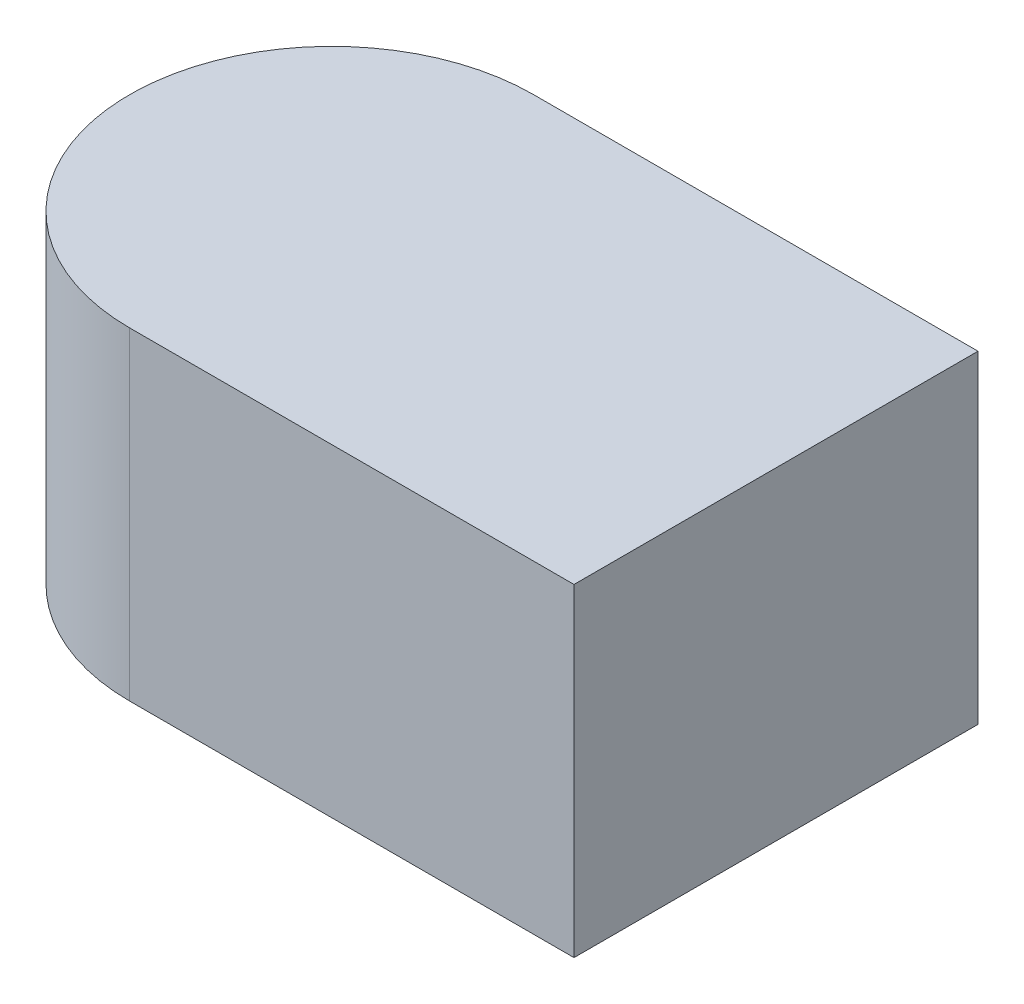
ISO-10303-21;
HEADER;
FILE_DESCRIPTION(('STEP AP214'),'2;1');
FILE_NAME('part.step','',(''),(''),'','','');
FILE_SCHEMA(('AUTOMOTIVE_DESIGN { 1 0 10303 214 1 1 1 1 }'));
ENDSEC;
DATA;
#1=APPLICATION_CONTEXT('core data for automotive mechanical design processes');
#2=APPLICATION_PROTOCOL_DEFINITION('international standard','automotive_design',2000,#1);
#3=PRODUCT_CONTEXT('',#1,'mechanical');
#4=PRODUCT('Part','Part','',(#3));
#5=PRODUCT_RELATED_PRODUCT_CATEGORY('part','',(#4));
#6=PRODUCT_DEFINITION_FORMATION('','',#4);
#7=PRODUCT_DEFINITION_CONTEXT('part definition',#1,'design');
#8=PRODUCT_DEFINITION('design','',#6,#7);
#9=PRODUCT_DEFINITION_SHAPE('','',#8);
#10=(LENGTH_UNIT() NAMED_UNIT(*) SI_UNIT(.MILLI.,.METRE.));
#11=(NAMED_UNIT(*) PLANE_ANGLE_UNIT() SI_UNIT($,.RADIAN.));
#12=(NAMED_UNIT(*) SI_UNIT($,.STERADIAN.) SOLID_ANGLE_UNIT());
#13=UNCERTAINTY_MEASURE_WITH_UNIT(LENGTH_MEASURE(1.E-05),#10,'distance_accuracy_value','');
#14=(GEOMETRIC_REPRESENTATION_CONTEXT(3) GLOBAL_UNCERTAINTY_ASSIGNED_CONTEXT((#13)) GLOBAL_UNIT_ASSIGNED_CONTEXT((#10,
#11,#12)) REPRESENTATION_CONTEXT('',''));
#15=CARTESIAN_POINT('',(0.,0.,0.));
#16=DIRECTION('',(0.,0.,1.));
#17=DIRECTION('',(1.,0.,0.));
#18=AXIS2_PLACEMENT_3D('',#15,#16,#17);
#19=CARTESIAN_POINT('',(0.,0.,0.));
#20=DIRECTION('',(0.,1.,0.));
#21=DIRECTION('',(1.,0.,0.));
#22=AXIS2_PLACEMENT_3D('',#19,#20,#21);
#23=PLANE('',#22);
#24=DIRECTION('',(0.,0.,-1.));
#25=VECTOR('',#24,1.);
#26=CARTESIAN_POINT('',(1.5,0.,-0.125));
#27=LINE('',#26,#25);
#28=CARTESIAN_POINT('',(1.5,0.,-0.125));
#29=VERTEX_POINT('',#28);
#30=CARTESIAN_POINT('',(1.5,0.,-0.375));
#31=VERTEX_POINT('',#30);
#32=EDGE_CURVE('E11',#29,#31,#27,.T.);
#33=ORIENTED_EDGE('',*,*,#32,.F.);
#34=DIRECTION('',(1.,0.,0.));
#35=VECTOR('',#34,1.);
#36=CARTESIAN_POINT('',(1.225,0.,-0.125));
#37=LINE('',#36,#35);
#38=CARTESIAN_POINT('',(1.225,0.,-0.125));
#39=VERTEX_POINT('',#38);
#40=EDGE_CURVE('E24',#39,#29,#37,.T.);
#41=ORIENTED_EDGE('',*,*,#40,.F.);
#42=CARTESIAN_POINT('',(1.225,0.,-0.25));
#43=DIRECTION('',(0.,1.,0.));
#44=DIRECTION('',(0.,0.,-1.));
#45=AXIS2_PLACEMENT_3D('',#42,#43,#44);
#46=CIRCLE('',#45,0.125);
#47=CARTESIAN_POINT('',(1.225,0.,-0.375));
#48=VERTEX_POINT('',#47);
#49=EDGE_CURVE('E61',#48,#39,#46,.T.);
#50=ORIENTED_EDGE('',*,*,#49,.F.);
#51=DIRECTION('',(-1.,0.,0.));
#52=VECTOR('',#51,1.);
#53=CARTESIAN_POINT('',(1.5,0.,-0.375));
#54=LINE('',#53,#52);
#55=EDGE_CURVE('E37',#31,#48,#54,.T.);
#56=ORIENTED_EDGE('',*,*,#55,.F.);
#57=EDGE_LOOP('',(#33,#41,#50,#56));
#58=FACE_BOUND('',#57,.T.);
#59=ADVANCED_FACE('F17',(#58),#23,.F.);
#60=CARTESIAN_POINT('',(1.5,0.,-0.375));
#61=DIRECTION('',(0.,0.,-1.));
#62=DIRECTION('',(-1.,0.,0.));
#63=AXIS2_PLACEMENT_3D('',#60,#61,#62);
#64=PLANE('',#63);
#65=DIRECTION('',(0.,1.,0.));
#66=VECTOR('',#65,1.);
#67=CARTESIAN_POINT('',(1.225,0.,-0.375));
#68=LINE('',#67,#66);
#69=CARTESIAN_POINT('',(1.225,0.2,-0.375));
#70=VERTEX_POINT('',#69);
#71=EDGE_CURVE('E84',#48,#70,#68,.T.);
#72=ORIENTED_EDGE('',*,*,#71,.T.);
#73=DIRECTION('',(-1.,0.,0.));
#74=VECTOR('',#73,1.);
#75=CARTESIAN_POINT('',(1.5,0.2,-0.375));
#76=LINE('',#75,#74);
#77=CARTESIAN_POINT('',(1.5,0.2,-0.375));
#78=VERTEX_POINT('',#77);
#79=EDGE_CURVE('E74',#78,#70,#76,.T.);
#80=ORIENTED_EDGE('',*,*,#79,.F.);
#81=DIRECTION('',(0.,1.,0.));
#82=VECTOR('',#81,1.);
#83=CARTESIAN_POINT('',(1.5,0.,-0.375));
#84=LINE('',#83,#82);
#85=EDGE_CURVE('E81',#31,#78,#84,.T.);
#86=ORIENTED_EDGE('',*,*,#85,.F.);
#87=ORIENTED_EDGE('',*,*,#55,.T.);
#88=EDGE_LOOP('',(#72,#80,#86,#87));
#89=FACE_BOUND('',#88,.T.);
#90=ADVANCED_FACE('F89',(#89),#64,.T.);
#91=CARTESIAN_POINT('',(1.5,0.,-0.125));
#92=DIRECTION('',(1.,0.,0.));
#93=DIRECTION('',(0.,0.,-1.));
#94=AXIS2_PLACEMENT_3D('',#91,#92,#93);
#95=PLANE('',#94);
#96=ORIENTED_EDGE('',*,*,#85,.T.);
#97=DIRECTION('',(0.,0.,-1.));
#98=VECTOR('',#97,1.);
#99=CARTESIAN_POINT('',(1.5,0.2,-0.125));
#100=LINE('',#99,#98);
#101=CARTESIAN_POINT('',(1.5,0.2,-0.125));
#102=VERTEX_POINT('',#101);
#103=EDGE_CURVE('E79',#102,#78,#100,.T.);
#104=ORIENTED_EDGE('',*,*,#103,.F.);
#105=DIRECTION('',(0.,1.,0.));
#106=VECTOR('',#105,1.);
#107=CARTESIAN_POINT('',(1.5,0.,-0.125));
#108=LINE('',#107,#106);
#109=EDGE_CURVE('E67',#29,#102,#108,.T.);
#110=ORIENTED_EDGE('',*,*,#109,.F.);
#111=ORIENTED_EDGE('',*,*,#32,.T.);
#112=EDGE_LOOP('',(#96,#104,#110,#111));
#113=FACE_BOUND('',#112,.T.);
#114=ADVANCED_FACE('F91',(#113),#95,.T.);
#115=CARTESIAN_POINT('',(1.225,0.,-0.125));
#116=DIRECTION('',(0.,0.,1.));
#117=DIRECTION('',(1.,0.,0.));
#118=AXIS2_PLACEMENT_3D('',#115,#116,#117);
#119=PLANE('',#118);
#120=ORIENTED_EDGE('',*,*,#109,.T.);
#121=DIRECTION('',(1.,0.,0.));
#122=VECTOR('',#121,1.);
#123=CARTESIAN_POINT('',(1.225,0.2,-0.125));
#124=LINE('',#123,#122);
#125=CARTESIAN_POINT('',(1.225,0.2,-0.125));
#126=VERTEX_POINT('',#125);
#127=EDGE_CURVE('E62',#126,#102,#124,.T.);
#128=ORIENTED_EDGE('',*,*,#127,.F.);
#129=DIRECTION('',(0.,1.,0.));
#130=VECTOR('',#129,1.);
#131=CARTESIAN_POINT('',(1.225,0.,-0.125));
#132=LINE('',#131,#130);
#133=EDGE_CURVE('E55',#39,#126,#132,.T.);
#134=ORIENTED_EDGE('',*,*,#133,.F.);
#135=ORIENTED_EDGE('',*,*,#40,.T.);
#136=EDGE_LOOP('',(#120,#128,#134,#135));
#137=FACE_BOUND('',#136,.T.);
#138=ADVANCED_FACE('F65',(#137),#119,.T.);
#139=CARTESIAN_POINT('',(1.225,0.,-0.25));
#140=DIRECTION('',(0.,1.,0.));
#141=DIRECTION('',(1.,0.,0.));
#142=AXIS2_PLACEMENT_3D('',#139,#140,#141);
#143=CYLINDRICAL_SURFACE('',#142,0.125);
#144=ORIENTED_EDGE('',*,*,#133,.T.);
#145=CARTESIAN_POINT('',(1.225,0.2,-0.25));
#146=DIRECTION('',(0.,1.,0.));
#147=DIRECTION('',(0.,0.,-1.));
#148=AXIS2_PLACEMENT_3D('',#145,#146,#147);
#149=CIRCLE('',#148,0.125);
#150=EDGE_CURVE('E60',#70,#126,#149,.T.);
#151=ORIENTED_EDGE('',*,*,#150,.F.);
#152=ORIENTED_EDGE('',*,*,#71,.F.);
#153=ORIENTED_EDGE('',*,*,#49,.T.);
#154=EDGE_LOOP('',(#144,#151,#152,#153));
#155=FACE_BOUND('',#154,.T.);
#156=ADVANCED_FACE('F57',(#155),#143,.T.);
#157=CARTESIAN_POINT('',(0.,0.2,0.));
#158=DIRECTION('',(0.,1.,0.));
#159=DIRECTION('',(1.,0.,0.));
#160=AXIS2_PLACEMENT_3D('',#157,#158,#159);
#161=PLANE('',#160);
#162=ORIENTED_EDGE('',*,*,#150,.T.);
#163=ORIENTED_EDGE('',*,*,#127,.T.);
#164=ORIENTED_EDGE('',*,*,#103,.T.);
#165=ORIENTED_EDGE('',*,*,#79,.T.);
#166=EDGE_LOOP('',(#162,#163,#164,#165));
#167=FACE_BOUND('',#166,.T.);
#168=ADVANCED_FACE('F72',(#167),#161,.T.);
#169=CLOSED_SHELL('',(#59,#90,#114,#138,#156,#168));
#170=MANIFOLD_SOLID_BREP('B1',#169);
#171=ADVANCED_BREP_SHAPE_REPRESENTATION('',(#18,#170),#14);
#172=SHAPE_DEFINITION_REPRESENTATION(#9,#171);
ENDSEC;
END-ISO-10303-21;
